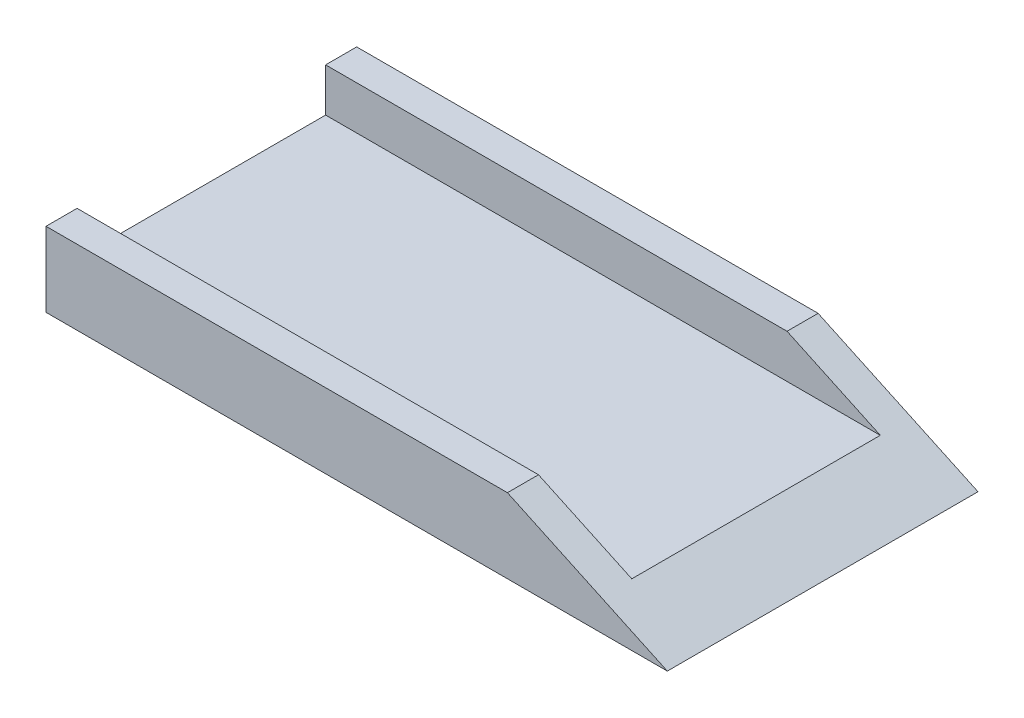
ISO-10303-21;
HEADER;
FILE_DESCRIPTION(('STEP AP214'),'2;1');
FILE_NAME('part.step','',(''),(''),'','','');
FILE_SCHEMA(('AUTOMOTIVE_DESIGN { 1 0 10303 214 1 1 1 1 }'));
ENDSEC;
DATA;
#1=APPLICATION_CONTEXT('core data for automotive mechanical design processes');
#2=APPLICATION_PROTOCOL_DEFINITION('international standard','automotive_design',2000,#1);
#3=PRODUCT_CONTEXT('',#1,'mechanical');
#4=PRODUCT('Part','Part','',(#3));
#5=PRODUCT_RELATED_PRODUCT_CATEGORY('part','',(#4));
#6=PRODUCT_DEFINITION_FORMATION('','',#4);
#7=PRODUCT_DEFINITION_CONTEXT('part definition',#1,'design');
#8=PRODUCT_DEFINITION('design','',#6,#7);
#9=PRODUCT_DEFINITION_SHAPE('','',#8);
#10=(LENGTH_UNIT() NAMED_UNIT(*) SI_UNIT(.MILLI.,.METRE.));
#11=(NAMED_UNIT(*) PLANE_ANGLE_UNIT() SI_UNIT($,.RADIAN.));
#12=(NAMED_UNIT(*) SI_UNIT($,.STERADIAN.) SOLID_ANGLE_UNIT());
#13=UNCERTAINTY_MEASURE_WITH_UNIT(LENGTH_MEASURE(1.E-05),#10,'distance_accuracy_value','');
#14=(GEOMETRIC_REPRESENTATION_CONTEXT(3) GLOBAL_UNCERTAINTY_ASSIGNED_CONTEXT((#13)) GLOBAL_UNIT_ASSIGNED_CONTEXT((#10,
#11,#12)) REPRESENTATION_CONTEXT('',''));
#15=CARTESIAN_POINT('',(0.,0.,0.));
#16=DIRECTION('',(0.,0.,1.));
#17=DIRECTION('',(1.,0.,0.));
#18=AXIS2_PLACEMENT_3D('',#15,#16,#17);
#19=CARTESIAN_POINT('',(0.,3.175,-63.5));
#20=DIRECTION('',(0.,-1.,0.));
#21=DIRECTION('',(1.,0.,0.));
#22=AXIS2_PLACEMENT_3D('',#19,#20,#21);
#23=PLANE('',#22);
#24=DIRECTION('',(-1.,0.,0.));
#25=VECTOR('',#24,1.);
#26=CARTESIAN_POINT('',(-63.5,3.175,-6.35));
#27=LINE('',#26,#25);
#28=CARTESIAN_POINT('',(49.882381054764,3.17500000000001,-6.35));
#29=VERTEX_POINT('',#28);
#30=CARTESIAN_POINT('',(-63.5,3.175,-6.35));
#31=VERTEX_POINT('',#30);
#32=EDGE_CURVE('E55',#29,#31,#27,.T.);
#33=ORIENTED_EDGE('',*,*,#32,.F.);
#34=DIRECTION('',(0.,0.,-1.));
#35=VECTOR('',#34,1.);
#36=CARTESIAN_POINT('',(49.8823810547641,3.175,-63.5));
#37=LINE('',#36,#35);
#38=CARTESIAN_POINT('',(49.8823810547641,3.175,-57.15));
#39=VERTEX_POINT('',#38);
#40=EDGE_CURVE('E167',#29,#39,#37,.T.);
#41=ORIENTED_EDGE('',*,*,#40,.T.);
#42=DIRECTION('',(1.,0.,0.));
#43=VECTOR('',#42,1.);
#44=CARTESIAN_POINT('',(63.5,3.175,-57.15));
#45=LINE('',#44,#43);
#46=CARTESIAN_POINT('',(-63.5,3.175,-57.15));
#47=VERTEX_POINT('',#46);
#48=EDGE_CURVE('E122',#47,#39,#45,.T.);
#49=ORIENTED_EDGE('',*,*,#48,.F.);
#50=DIRECTION('',(0.,0.,1.));
#51=VECTOR('',#50,1.);
#52=CARTESIAN_POINT('',(-63.5,3.175,-63.5));
#53=LINE('',#52,#51);
#54=EDGE_CURVE('E138',#47,#31,#53,.T.);
#55=ORIENTED_EDGE('',*,*,#54,.T.);
#56=EDGE_LOOP('',(#33,#41,#49,#55));
#57=FACE_BOUND('',#56,.T.);
#58=ADVANCED_FACE('F35',(#57),#23,.F.);
#59=CARTESIAN_POINT('',(0.,-3.175,-63.5));
#60=DIRECTION('',(0.,-1.,0.));
#61=DIRECTION('',(0.,0.,-1.));
#62=AXIS2_PLACEMENT_3D('',#59,#60,#61);
#63=PLANE('',#62);
#64=DIRECTION('',(1.,0.,0.));
#65=VECTOR('',#64,1.);
#66=CARTESIAN_POINT('',(0.,-3.175,0.));
#67=LINE('',#66,#65);
#68=CARTESIAN_POINT('',(-63.5,-3.175,0.));
#69=VERTEX_POINT('',#68);
#70=CARTESIAN_POINT('',(63.5,-3.175,0.));
#71=VERTEX_POINT('',#70);
#72=EDGE_CURVE('E146',#69,#71,#67,.T.);
#73=ORIENTED_EDGE('',*,*,#72,.F.);
#74=DIRECTION('',(0.,0.,1.));
#75=VECTOR('',#74,1.);
#76=CARTESIAN_POINT('',(-63.5,-3.175,-63.5));
#77=LINE('',#76,#75);
#78=CARTESIAN_POINT('',(-63.5,-3.175,-63.5));
#79=VERTEX_POINT('',#78);
#80=EDGE_CURVE('E156',#79,#69,#77,.T.);
#81=ORIENTED_EDGE('',*,*,#80,.F.);
#82=DIRECTION('',(1.,0.,0.));
#83=VECTOR('',#82,1.);
#84=CARTESIAN_POINT('',(0.,-3.175,-63.5));
#85=LINE('',#84,#83);
#86=CARTESIAN_POINT('',(63.5,-3.175,-63.5));
#87=VERTEX_POINT('',#86);
#88=EDGE_CURVE('E153',#79,#87,#85,.T.);
#89=ORIENTED_EDGE('',*,*,#88,.T.);
#90=DIRECTION('',(0.,0.,1.));
#91=VECTOR('',#90,1.);
#92=CARTESIAN_POINT('',(63.5,-3.175,-63.5));
#93=LINE('',#92,#91);
#94=EDGE_CURVE('E42',#87,#71,#93,.T.);
#95=ORIENTED_EDGE('',*,*,#94,.T.);
#96=EDGE_LOOP('',(#73,#81,#89,#95));
#97=FACE_BOUND('',#96,.T.);
#98=ADVANCED_FACE('F184',(#97),#63,.T.);
#99=CARTESIAN_POINT('',(-63.5,0.,-63.5));
#100=DIRECTION('',(-1.,0.,0.));
#101=DIRECTION('',(0.,0.,1.));
#102=AXIS2_PLACEMENT_3D('',#99,#100,#101);
#103=PLANE('',#102);
#104=DIRECTION('',(0.,-1.,0.));
#105=VECTOR('',#104,1.);
#106=CARTESIAN_POINT('',(-63.5,0.,0.));
#107=LINE('',#106,#105);
#108=CARTESIAN_POINT('',(-63.5,12.065,0.));
#109=VERTEX_POINT('',#108);
#110=EDGE_CURVE('E141',#109,#69,#107,.T.);
#111=ORIENTED_EDGE('',*,*,#110,.F.);
#112=DIRECTION('',(0.,0.,1.));
#113=VECTOR('',#112,1.);
#114=CARTESIAN_POINT('',(-63.5,12.065,0.));
#115=LINE('',#114,#113);
#116=CARTESIAN_POINT('',(-63.5,12.065,-6.35));
#117=VERTEX_POINT('',#116);
#118=EDGE_CURVE('E169',#117,#109,#115,.T.);
#119=ORIENTED_EDGE('',*,*,#118,.F.);
#120=DIRECTION('',(0.,-1.,0.));
#121=VECTOR('',#120,1.);
#122=CARTESIAN_POINT('',(-63.5,12.065,-6.35));
#123=LINE('',#122,#121);
#124=EDGE_CURVE('E126',#117,#31,#123,.T.);
#125=ORIENTED_EDGE('',*,*,#124,.T.);
#126=ORIENTED_EDGE('',*,*,#54,.F.);
#127=DIRECTION('',(0.,-1.,0.));
#128=VECTOR('',#127,1.);
#129=CARTESIAN_POINT('',(-63.5,12.065,-57.15));
#130=LINE('',#129,#128);
#131=CARTESIAN_POINT('',(-63.5,12.065,-57.15));
#132=VERTEX_POINT('',#131);
#133=EDGE_CURVE('E132',#132,#47,#130,.T.);
#134=ORIENTED_EDGE('',*,*,#133,.F.);
#135=DIRECTION('',(0.,0.,1.));
#136=VECTOR('',#135,1.);
#137=CARTESIAN_POINT('',(-63.5,12.065,-63.5));
#138=LINE('',#137,#136);
#139=CARTESIAN_POINT('',(-63.5,12.065,-63.5));
#140=VERTEX_POINT('',#139);
#141=EDGE_CURVE('E121',#140,#132,#138,.T.);
#142=ORIENTED_EDGE('',*,*,#141,.F.);
#143=DIRECTION('',(0.,-1.,0.));
#144=VECTOR('',#143,1.);
#145=CARTESIAN_POINT('',(-63.5,0.,-63.5));
#146=LINE('',#145,#144);
#147=EDGE_CURVE('E119',#140,#79,#146,.T.);
#148=ORIENTED_EDGE('',*,*,#147,.T.);
#149=ORIENTED_EDGE('',*,*,#80,.T.);
#150=EDGE_LOOP('',(#111,#119,#125,#126,#134,#142,#148,#149));
#151=FACE_BOUND('',#150,.T.);
#152=ADVANCED_FACE('F163',(#151),#103,.T.);
#153=CARTESIAN_POINT('',(0.,0.,-63.5));
#154=DIRECTION('',(0.,0.,1.));
#155=DIRECTION('',(1.,0.,0.));
#156=AXIS2_PLACEMENT_3D('',#153,#154,#155);
#157=PLANE('',#156);
#158=DIRECTION('',(-1.,0.,0.));
#159=VECTOR('',#158,1.);
#160=CARTESIAN_POINT('',(63.5,12.065,-63.5));
#161=LINE('',#160,#159);
#162=CARTESIAN_POINT('',(30.8177145314338,12.065,-63.5));
#163=VERTEX_POINT('',#162);
#164=EDGE_CURVE('E112',#163,#140,#161,.T.);
#165=ORIENTED_EDGE('',*,*,#164,.F.);
#166=DIRECTION('',(0.906307787036653,-0.422618261740694,0.));
#167=VECTOR('',#166,1.);
#168=CARTESIAN_POINT('',(63.5,-3.175,-63.5));
#169=LINE('',#168,#167);
#170=EDGE_CURVE('E97',#163,#87,#169,.T.);
#171=ORIENTED_EDGE('',*,*,#170,.T.);
#172=ORIENTED_EDGE('',*,*,#88,.F.);
#173=ORIENTED_EDGE('',*,*,#147,.F.);
#174=EDGE_LOOP('',(#165,#171,#172,#173));
#175=FACE_BOUND('',#174,.T.);
#176=ADVANCED_FACE('F117',(#175),#157,.F.);
#177=CARTESIAN_POINT('',(0.,0.,0.));
#178=DIRECTION('',(0.,0.,1.));
#179=DIRECTION('',(1.,0.,0.));
#180=AXIS2_PLACEMENT_3D('',#177,#178,#179);
#181=PLANE('',#180);
#182=DIRECTION('',(0.906307787036653,-0.422618261740694,0.));
#183=VECTOR('',#182,1.);
#184=CARTESIAN_POINT('',(63.5,-3.175,0.));
#185=LINE('',#184,#183);
#186=CARTESIAN_POINT('',(30.8177145314338,12.065,0.));
#187=VERTEX_POINT('',#186);
#188=EDGE_CURVE('E107',#187,#71,#185,.T.);
#189=ORIENTED_EDGE('',*,*,#188,.F.);
#190=DIRECTION('',(1.,0.,0.));
#191=VECTOR('',#190,1.);
#192=CARTESIAN_POINT('',(-63.5,12.065,0.));
#193=LINE('',#192,#191);
#194=EDGE_CURVE('E175',#109,#187,#193,.T.);
#195=ORIENTED_EDGE('',*,*,#194,.F.);
#196=ORIENTED_EDGE('',*,*,#110,.T.);
#197=ORIENTED_EDGE('',*,*,#72,.T.);
#198=EDGE_LOOP('',(#189,#195,#196,#197));
#199=FACE_BOUND('',#198,.T.);
#200=ADVANCED_FACE('F193',(#199),#181,.T.);
#201=CARTESIAN_POINT('',(63.5,12.065,-57.15));
#202=DIRECTION('',(0.,0.,-1.));
#203=DIRECTION('',(-1.,0.,0.));
#204=AXIS2_PLACEMENT_3D('',#201,#202,#203);
#205=PLANE('',#204);
#206=ORIENTED_EDGE('',*,*,#48,.T.);
#207=DIRECTION('',(-0.906307787036653,0.422618261740694,0.));
#208=VECTOR('',#207,1.);
#209=CARTESIAN_POINT('',(57.6627413434334,-0.453041585811503,-57.15));
#210=LINE('',#209,#208);
#211=CARTESIAN_POINT('',(30.8177145314338,12.065,-57.15));
#212=VERTEX_POINT('',#211);
#213=EDGE_CURVE('E165',#39,#212,#210,.T.);
#214=ORIENTED_EDGE('',*,*,#213,.T.);
#215=DIRECTION('',(1.,0.,0.));
#216=VECTOR('',#215,1.);
#217=CARTESIAN_POINT('',(63.5,12.065,-57.15));
#218=LINE('',#217,#216);
#219=EDGE_CURVE('E115',#132,#212,#218,.T.);
#220=ORIENTED_EDGE('',*,*,#219,.F.);
#221=ORIENTED_EDGE('',*,*,#133,.T.);
#222=EDGE_LOOP('',(#206,#214,#220,#221));
#223=FACE_BOUND('',#222,.T.);
#224=ADVANCED_FACE('F164',(#223),#205,.F.);
#225=CARTESIAN_POINT('',(0.,12.065,0.));
#226=DIRECTION('',(0.,-1.,0.));
#227=DIRECTION('',(0.,0.,-1.));
#228=AXIS2_PLACEMENT_3D('',#225,#226,#227);
#229=PLANE('',#228);
#230=ORIENTED_EDGE('',*,*,#219,.T.);
#231=DIRECTION('',(0.,0.,1.));
#232=VECTOR('',#231,1.);
#233=CARTESIAN_POINT('',(30.8177145314338,12.065,-63.5));
#234=LINE('',#233,#232);
#235=EDGE_CURVE('E100',#163,#212,#234,.T.);
#236=ORIENTED_EDGE('',*,*,#235,.F.);
#237=ORIENTED_EDGE('',*,*,#164,.T.);
#238=ORIENTED_EDGE('',*,*,#141,.T.);
#239=EDGE_LOOP('',(#230,#236,#237,#238));
#240=FACE_BOUND('',#239,.T.);
#241=ADVANCED_FACE('F111',(#240),#229,.F.);
#242=CARTESIAN_POINT('',(-63.5,12.065,-6.35));
#243=DIRECTION('',(0.,0.,1.));
#244=DIRECTION('',(1.,0.,0.));
#245=AXIS2_PLACEMENT_3D('',#242,#243,#244);
#246=PLANE('',#245);
#247=DIRECTION('',(-1.,0.,0.));
#248=VECTOR('',#247,1.);
#249=CARTESIAN_POINT('',(-63.5,12.065,-6.35));
#250=LINE('',#249,#248);
#251=CARTESIAN_POINT('',(30.8177145314338,12.065,-6.35));
#252=VERTEX_POINT('',#251);
#253=EDGE_CURVE('E178',#252,#117,#250,.T.);
#254=ORIENTED_EDGE('',*,*,#253,.F.);
#255=DIRECTION('',(0.906307787036653,-0.422618261740694,0.));
#256=VECTOR('',#255,1.);
#257=CARTESIAN_POINT('',(-46.6542718716624,48.1907805522431,-6.35));
#258=LINE('',#257,#256);
#259=EDGE_CURVE('E49',#252,#29,#258,.T.);
#260=ORIENTED_EDGE('',*,*,#259,.T.);
#261=ORIENTED_EDGE('',*,*,#32,.T.);
#262=ORIENTED_EDGE('',*,*,#124,.F.);
#263=EDGE_LOOP('',(#254,#260,#261,#262));
#264=FACE_BOUND('',#263,.T.);
#265=ADVANCED_FACE('F182',(#264),#246,.F.);
#266=CARTESIAN_POINT('',(0.,12.065,0.));
#267=DIRECTION('',(0.,-1.,0.));
#268=DIRECTION('',(0.,0.,-1.));
#269=AXIS2_PLACEMENT_3D('',#266,#267,#268);
#270=PLANE('',#269);
#271=ORIENTED_EDGE('',*,*,#194,.T.);
#272=DIRECTION('',(0.,0.,-1.));
#273=VECTOR('',#272,1.);
#274=CARTESIAN_POINT('',(30.8177145314338,12.065,0.));
#275=LINE('',#274,#273);
#276=EDGE_CURVE('E11',#187,#252,#275,.T.);
#277=ORIENTED_EDGE('',*,*,#276,.T.);
#278=ORIENTED_EDGE('',*,*,#253,.T.);
#279=ORIENTED_EDGE('',*,*,#118,.T.);
#280=EDGE_LOOP('',(#271,#277,#278,#279));
#281=FACE_BOUND('',#280,.T.);
#282=ADVANCED_FACE('F204',(#281),#270,.F.);
#283=CARTESIAN_POINT('',(63.5,-3.175,-63.5));
#284=DIRECTION('',(-0.422618261740694,-0.906307787036653,0.));
#285=DIRECTION('',(0.906307787036653,-0.422618261740694,0.));
#286=AXIS2_PLACEMENT_3D('',#283,#284,#285);
#287=PLANE('',#286);
#288=ORIENTED_EDGE('',*,*,#40,.F.);
#289=ORIENTED_EDGE('',*,*,#259,.F.);
#290=ORIENTED_EDGE('',*,*,#276,.F.);
#291=ORIENTED_EDGE('',*,*,#188,.T.);
#292=ORIENTED_EDGE('',*,*,#94,.F.);
#293=ORIENTED_EDGE('',*,*,#170,.F.);
#294=ORIENTED_EDGE('',*,*,#235,.T.);
#295=ORIENTED_EDGE('',*,*,#213,.F.);
#296=EDGE_LOOP('',(#288,#289,#290,#291,#292,#293,#294,#295));
#297=FACE_BOUND('',#296,.T.);
#298=ADVANCED_FACE('F99',(#297),#287,.F.);
#299=CLOSED_SHELL('',(#58,#98,#152,#176,#200,#224,#241,#265,#282,#298));
#300=MANIFOLD_SOLID_BREP('B2',#299);
#301=ADVANCED_BREP_SHAPE_REPRESENTATION('',(#18,#300),#14);
#302=SHAPE_DEFINITION_REPRESENTATION(#9,#301);
ENDSEC;
END-ISO-10303-21;
